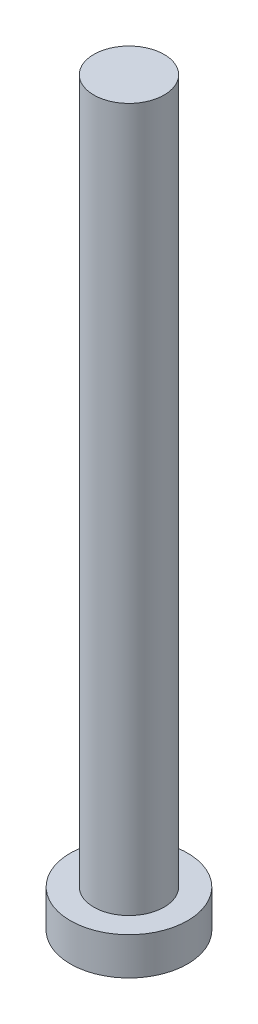
ISO-10303-21;
HEADER;
FILE_DESCRIPTION(('STEP AP214'),'2;1');
FILE_NAME('part.step','',(''),(''),'','','');
FILE_SCHEMA(('AUTOMOTIVE_DESIGN { 1 0 10303 214 1 1 1 1 }'));
ENDSEC;
DATA;
#1=APPLICATION_CONTEXT('core data for automotive mechanical design processes');
#2=APPLICATION_PROTOCOL_DEFINITION('international standard','automotive_design',2000,#1);
#3=PRODUCT_CONTEXT('',#1,'mechanical');
#4=PRODUCT('Part','Part','',(#3));
#5=PRODUCT_RELATED_PRODUCT_CATEGORY('part','',(#4));
#6=PRODUCT_DEFINITION_FORMATION('','',#4);
#7=PRODUCT_DEFINITION_CONTEXT('part definition',#1,'design');
#8=PRODUCT_DEFINITION('design','',#6,#7);
#9=PRODUCT_DEFINITION_SHAPE('','',#8);
#10=(LENGTH_UNIT() NAMED_UNIT(*) SI_UNIT(.MILLI.,.METRE.));
#11=(NAMED_UNIT(*) PLANE_ANGLE_UNIT() SI_UNIT($,.RADIAN.));
#12=(NAMED_UNIT(*) SI_UNIT($,.STERADIAN.) SOLID_ANGLE_UNIT());
#13=UNCERTAINTY_MEASURE_WITH_UNIT(LENGTH_MEASURE(1.E-05),#10,'distance_accuracy_value','');
#14=(GEOMETRIC_REPRESENTATION_CONTEXT(3) GLOBAL_UNCERTAINTY_ASSIGNED_CONTEXT((#13)) GLOBAL_UNIT_ASSIGNED_CONTEXT((#10,
#11,#12)) REPRESENTATION_CONTEXT('',''));
#15=CARTESIAN_POINT('',(0.,0.,0.));
#16=DIRECTION('',(0.,0.,1.));
#17=DIRECTION('',(1.,0.,0.));
#18=AXIS2_PLACEMENT_3D('',#15,#16,#17);
#19=CARTESIAN_POINT('',(0.,0.,0.));
#20=DIRECTION('',(0.,1.,0.));
#21=DIRECTION('',(0.,0.,1.));
#22=AXIS2_PLACEMENT_3D('',#19,#20,#21);
#23=PLANE('',#22);
#24=CARTESIAN_POINT('',(0.,0.,0.));
#25=DIRECTION('',(0.,1.,0.));
#26=DIRECTION('',(0.,0.,1.));
#27=AXIS2_PLACEMENT_3D('',#24,#25,#26);
#28=CIRCLE('',#27,2.5);
#29=CARTESIAN_POINT('',(0.,0.,2.5));
#30=VERTEX_POINT('',#29);
#31=EDGE_CURVE('E39',#30,#30,#28,.T.);
#32=ORIENTED_EDGE('',*,*,#31,.F.);
#33=EDGE_LOOP('',(#32));
#34=FACE_BOUND('',#33,.T.);
#35=CARTESIAN_POINT('',(1.,0.,1.));
#36=DIRECTION('',(0.,1.,0.));
#37=DIRECTION('',(0.,0.,-1.));
#38=AXIS2_PLACEMENT_3D('',#35,#36,#37);
#39=CIRCLE('',#38,0.5);
#40=CARTESIAN_POINT('',(1.,0.,0.5));
#41=VERTEX_POINT('',#40);
#42=CARTESIAN_POINT('',(0.5,0.,1.));
#43=VERTEX_POINT('',#42);
#44=EDGE_CURVE('E186',#41,#43,#39,.T.);
#45=ORIENTED_EDGE('',*,*,#44,.F.);
#46=DIRECTION('',(-1.,0.,0.));
#47=VECTOR('',#46,1.);
#48=CARTESIAN_POINT('',(1.,0.,0.5));
#49=LINE('',#48,#47);
#50=CARTESIAN_POINT('',(1.75,0.,0.5));
#51=VERTEX_POINT('',#50);
#52=EDGE_CURVE('E52',#51,#41,#49,.T.);
#53=ORIENTED_EDGE('',*,*,#52,.F.);
#54=DIRECTION('',(0.,0.,1.));
#55=VECTOR('',#54,1.);
#56=CARTESIAN_POINT('',(1.75,0.,-0.5));
#57=LINE('',#56,#55);
#58=CARTESIAN_POINT('',(1.75,0.,-0.5));
#59=VERTEX_POINT('',#58);
#60=EDGE_CURVE('E225',#59,#51,#57,.T.);
#61=ORIENTED_EDGE('',*,*,#60,.F.);
#62=DIRECTION('',(1.,0.,0.));
#63=VECTOR('',#62,1.);
#64=CARTESIAN_POINT('',(1.,0.,-0.5));
#65=LINE('',#64,#63);
#66=CARTESIAN_POINT('',(1.,0.,-0.5));
#67=VERTEX_POINT('',#66);
#68=EDGE_CURVE('E223',#67,#59,#65,.T.);
#69=ORIENTED_EDGE('',*,*,#68,.F.);
#70=CARTESIAN_POINT('',(1.,0.,-1.));
#71=DIRECTION('',(0.,1.,0.));
#72=DIRECTION('',(0.,0.,-1.));
#73=AXIS2_PLACEMENT_3D('',#70,#71,#72);
#74=CIRCLE('',#73,0.5);
#75=CARTESIAN_POINT('',(0.5,0.,-1.));
#76=VERTEX_POINT('',#75);
#77=EDGE_CURVE('E160',#76,#67,#74,.T.);
#78=ORIENTED_EDGE('',*,*,#77,.F.);
#79=DIRECTION('',(0.,0.,1.));
#80=VECTOR('',#79,1.);
#81=CARTESIAN_POINT('',(0.5,0.,-1.75));
#82=LINE('',#81,#80);
#83=CARTESIAN_POINT('',(0.5,0.,-1.75));
#84=VERTEX_POINT('',#83);
#85=EDGE_CURVE('E219',#84,#76,#82,.T.);
#86=ORIENTED_EDGE('',*,*,#85,.F.);
#87=DIRECTION('',(1.,0.,0.));
#88=VECTOR('',#87,1.);
#89=CARTESIAN_POINT('',(-0.5,0.,-1.75));
#90=LINE('',#89,#88);
#91=CARTESIAN_POINT('',(-0.5,0.,-1.75));
#92=VERTEX_POINT('',#91);
#93=EDGE_CURVE('E216',#92,#84,#90,.T.);
#94=ORIENTED_EDGE('',*,*,#93,.F.);
#95=DIRECTION('',(0.,0.,-1.));
#96=VECTOR('',#95,1.);
#97=CARTESIAN_POINT('',(-0.5,0.,-1.75));
#98=LINE('',#97,#96);
#99=CARTESIAN_POINT('',(-0.5,0.,-1.));
#100=VERTEX_POINT('',#99);
#101=EDGE_CURVE('E213',#100,#92,#98,.T.);
#102=ORIENTED_EDGE('',*,*,#101,.F.);
#103=CARTESIAN_POINT('',(-1.,0.,-1.));
#104=DIRECTION('',(0.,1.,0.));
#105=DIRECTION('',(0.,0.,-1.));
#106=AXIS2_PLACEMENT_3D('',#103,#104,#105);
#107=CIRCLE('',#106,0.5);
#108=CARTESIAN_POINT('',(-1.,0.,-0.5));
#109=VERTEX_POINT('',#108);
#110=EDGE_CURVE('E210',#109,#100,#107,.T.);
#111=ORIENTED_EDGE('',*,*,#110,.F.);
#112=DIRECTION('',(1.,0.,0.));
#113=VECTOR('',#112,1.);
#114=CARTESIAN_POINT('',(-1.75,0.,-0.5));
#115=LINE('',#114,#113);
#116=CARTESIAN_POINT('',(-1.75,0.,-0.5));
#117=VERTEX_POINT('',#116);
#118=EDGE_CURVE('E207',#117,#109,#115,.T.);
#119=ORIENTED_EDGE('',*,*,#118,.F.);
#120=DIRECTION('',(0.,0.,-1.));
#121=VECTOR('',#120,1.);
#122=CARTESIAN_POINT('',(-1.75,0.,-0.5));
#123=LINE('',#122,#121);
#124=CARTESIAN_POINT('',(-1.75,0.,0.5));
#125=VERTEX_POINT('',#124);
#126=EDGE_CURVE('E204',#125,#117,#123,.T.);
#127=ORIENTED_EDGE('',*,*,#126,.F.);
#128=DIRECTION('',(-1.,0.,0.));
#129=VECTOR('',#128,1.);
#130=CARTESIAN_POINT('',(-1.75,0.,0.5));
#131=LINE('',#130,#129);
#132=CARTESIAN_POINT('',(-1.,0.,0.5));
#133=VERTEX_POINT('',#132);
#134=EDGE_CURVE('E201',#133,#125,#131,.T.);
#135=ORIENTED_EDGE('',*,*,#134,.F.);
#136=CARTESIAN_POINT('',(-1.,0.,1.));
#137=DIRECTION('',(0.,1.,0.));
#138=DIRECTION('',(0.,0.,1.));
#139=AXIS2_PLACEMENT_3D('',#136,#137,#138);
#140=CIRCLE('',#139,0.5);
#141=CARTESIAN_POINT('',(-0.5,0.,1.));
#142=VERTEX_POINT('',#141);
#143=EDGE_CURVE('E198',#142,#133,#140,.T.);
#144=ORIENTED_EDGE('',*,*,#143,.F.);
#145=DIRECTION('',(0.,0.,-1.));
#146=VECTOR('',#145,1.);
#147=CARTESIAN_POINT('',(-0.5,0.,1.));
#148=LINE('',#147,#146);
#149=CARTESIAN_POINT('',(-0.5,0.,1.75));
#150=VERTEX_POINT('',#149);
#151=EDGE_CURVE('E195',#150,#142,#148,.T.);
#152=ORIENTED_EDGE('',*,*,#151,.F.);
#153=DIRECTION('',(-1.,0.,0.));
#154=VECTOR('',#153,1.);
#155=CARTESIAN_POINT('',(-0.5,0.,1.75));
#156=LINE('',#155,#154);
#157=CARTESIAN_POINT('',(0.5,0.,1.75));
#158=VERTEX_POINT('',#157);
#159=EDGE_CURVE('E192',#158,#150,#156,.T.);
#160=ORIENTED_EDGE('',*,*,#159,.F.);
#161=DIRECTION('',(0.,0.,1.));
#162=VECTOR('',#161,1.);
#163=CARTESIAN_POINT('',(0.5,0.,1.));
#164=LINE('',#163,#162);
#165=EDGE_CURVE('E189',#43,#158,#164,.T.);
#166=ORIENTED_EDGE('',*,*,#165,.F.);
#167=EDGE_LOOP('',(#45,#53,#61,#69,#78,#86,#94,#102,#111,#119,#127,#135,#144,#152,#160,#166));
#168=FACE_BOUND('',#167,.T.);
#169=ADVANCED_FACE('F35',(#34,#168),#23,.F.);
#170=CARTESIAN_POINT('',(0.,1.6,0.));
#171=DIRECTION('',(0.,-1.,0.));
#172=DIRECTION('',(0.,0.,-1.));
#173=AXIS2_PLACEMENT_3D('',#170,#171,#172);
#174=CYLINDRICAL_SURFACE('',#173,2.5);
#175=CARTESIAN_POINT('',(0.,1.6,0.));
#176=DIRECTION('',(0.,1.,0.));
#177=DIRECTION('',(0.,0.,1.));
#178=AXIS2_PLACEMENT_3D('',#175,#176,#177);
#179=CIRCLE('',#178,2.5);
#180=CARTESIAN_POINT('',(0.,1.6,2.5));
#181=VERTEX_POINT('',#180);
#182=EDGE_CURVE('E44',#181,#181,#179,.T.);
#183=ORIENTED_EDGE('',*,*,#182,.F.);
#184=EDGE_LOOP('',(#183));
#185=FACE_BOUND('',#184,.T.);
#186=ORIENTED_EDGE('',*,*,#31,.T.);
#187=EDGE_LOOP('',(#186));
#188=FACE_BOUND('',#187,.T.);
#189=ADVANCED_FACE('F37',(#185,#188),#174,.T.);
#190=CARTESIAN_POINT('',(0.,1.6,0.));
#191=DIRECTION('',(0.,1.,0.));
#192=DIRECTION('',(0.,0.,1.));
#193=AXIS2_PLACEMENT_3D('',#190,#191,#192);
#194=PLANE('',#193);
#195=CARTESIAN_POINT('',(0.,1.6,0.));
#196=DIRECTION('',(0.,1.,0.));
#197=DIRECTION('',(0.,0.,1.));
#198=AXIS2_PLACEMENT_3D('',#195,#196,#197);
#199=CIRCLE('',#198,1.5);
#200=CARTESIAN_POINT('',(0.,1.6,1.5));
#201=VERTEX_POINT('',#200);
#202=EDGE_CURVE('E11',#201,#201,#199,.T.);
#203=ORIENTED_EDGE('',*,*,#202,.F.);
#204=EDGE_LOOP('',(#203));
#205=FACE_BOUND('',#204,.T.);
#206=ORIENTED_EDGE('',*,*,#182,.T.);
#207=EDGE_LOOP('',(#206));
#208=FACE_BOUND('',#207,.T.);
#209=ADVANCED_FACE('F374',(#205,#208),#194,.T.);
#210=CARTESIAN_POINT('',(0.,31.6,0.));
#211=DIRECTION('',(0.,-1.,0.));
#212=DIRECTION('',(0.,0.,-1.));
#213=AXIS2_PLACEMENT_3D('',#210,#211,#212);
#214=CYLINDRICAL_SURFACE('',#213,1.5);
#215=CARTESIAN_POINT('',(0.,31.6,0.));
#216=DIRECTION('',(0.,1.,0.));
#217=DIRECTION('',(0.,0.,1.));
#218=AXIS2_PLACEMENT_3D('',#215,#216,#217);
#219=CIRCLE('',#218,1.5);
#220=CARTESIAN_POINT('',(0.,31.6,1.5));
#221=VERTEX_POINT('',#220);
#222=EDGE_CURVE('E229',#221,#221,#219,.T.);
#223=ORIENTED_EDGE('',*,*,#222,.F.);
#224=EDGE_LOOP('',(#223));
#225=FACE_BOUND('',#224,.T.);
#226=ORIENTED_EDGE('',*,*,#202,.T.);
#227=EDGE_LOOP('',(#226));
#228=FACE_BOUND('',#227,.T.);
#229=ADVANCED_FACE('F370',(#225,#228),#214,.T.);
#230=CARTESIAN_POINT('',(0.,31.6,0.));
#231=DIRECTION('',(0.,1.,0.));
#232=DIRECTION('',(0.,0.,1.));
#233=AXIS2_PLACEMENT_3D('',#230,#231,#232);
#234=PLANE('',#233);
#235=ORIENTED_EDGE('',*,*,#222,.T.);
#236=EDGE_LOOP('',(#235));
#237=FACE_BOUND('',#236,.T.);
#238=ADVANCED_FACE('F320',(#237),#234,.T.);
#239=CARTESIAN_POINT('',(1.,1.,0.5));
#240=DIRECTION('',(0.,0.,1.));
#241=DIRECTION('',(1.,0.,0.));
#242=AXIS2_PLACEMENT_3D('',#239,#240,#241);
#243=PLANE('',#242);
#244=ORIENTED_EDGE('',*,*,#52,.T.);
#245=DIRECTION('',(0.,-1.,0.));
#246=VECTOR('',#245,1.);
#247=CARTESIAN_POINT('',(1.,1.,0.5));
#248=LINE('',#247,#246);
#249=CARTESIAN_POINT('',(1.,1.,0.5));
#250=VERTEX_POINT('',#249);
#251=EDGE_CURVE('E112',#250,#41,#248,.T.);
#252=ORIENTED_EDGE('',*,*,#251,.F.);
#253=DIRECTION('',(-1.,0.,0.));
#254=VECTOR('',#253,1.);
#255=CARTESIAN_POINT('',(1.,1.,0.5));
#256=LINE('',#255,#254);
#257=CARTESIAN_POINT('',(1.75,1.,0.5));
#258=VERTEX_POINT('',#257);
#259=EDGE_CURVE('E227',#258,#250,#256,.T.);
#260=ORIENTED_EDGE('',*,*,#259,.F.);
#261=DIRECTION('',(0.,-1.,0.));
#262=VECTOR('',#261,1.);
#263=CARTESIAN_POINT('',(1.75,1.,0.5));
#264=LINE('',#263,#262);
#265=EDGE_CURVE('E60',#258,#51,#264,.T.);
#266=ORIENTED_EDGE('',*,*,#265,.T.);
#267=EDGE_LOOP('',(#244,#252,#260,#266));
#268=FACE_BOUND('',#267,.T.);
#269=ADVANCED_FACE('F313',(#268),#243,.F.);
#270=CARTESIAN_POINT('',(1.75,1.,-0.5));
#271=DIRECTION('',(1.,0.,0.));
#272=DIRECTION('',(0.,0.,-1.));
#273=AXIS2_PLACEMENT_3D('',#270,#271,#272);
#274=PLANE('',#273);
#275=ORIENTED_EDGE('',*,*,#60,.T.);
#276=ORIENTED_EDGE('',*,*,#265,.F.);
#277=DIRECTION('',(0.,0.,1.));
#278=VECTOR('',#277,1.);
#279=CARTESIAN_POINT('',(1.75,1.,-0.5));
#280=LINE('',#279,#278);
#281=CARTESIAN_POINT('',(1.75,1.,-0.5));
#282=VERTEX_POINT('',#281);
#283=EDGE_CURVE('E172',#282,#258,#280,.T.);
#284=ORIENTED_EDGE('',*,*,#283,.F.);
#285=DIRECTION('',(0.,-1.,0.));
#286=VECTOR('',#285,1.);
#287=CARTESIAN_POINT('',(1.75,1.,-0.5));
#288=LINE('',#287,#286);
#289=EDGE_CURVE('E164',#282,#59,#288,.T.);
#290=ORIENTED_EDGE('',*,*,#289,.T.);
#291=EDGE_LOOP('',(#275,#276,#284,#290));
#292=FACE_BOUND('',#291,.T.);
#293=ADVANCED_FACE('F311',(#292),#274,.F.);
#294=CARTESIAN_POINT('',(1.,1.,-0.5));
#295=DIRECTION('',(0.,0.,-1.));
#296=DIRECTION('',(-1.,0.,0.));
#297=AXIS2_PLACEMENT_3D('',#294,#295,#296);
#298=PLANE('',#297);
#299=ORIENTED_EDGE('',*,*,#68,.T.);
#300=ORIENTED_EDGE('',*,*,#289,.F.);
#301=DIRECTION('',(1.,0.,0.));
#302=VECTOR('',#301,1.);
#303=CARTESIAN_POINT('',(1.,1.,-0.5));
#304=LINE('',#303,#302);
#305=CARTESIAN_POINT('',(1.,1.,-0.5));
#306=VERTEX_POINT('',#305);
#307=EDGE_CURVE('E168',#306,#282,#304,.T.);
#308=ORIENTED_EDGE('',*,*,#307,.F.);
#309=DIRECTION('',(0.,-1.,0.));
#310=VECTOR('',#309,1.);
#311=CARTESIAN_POINT('',(1.,1.,-0.5));
#312=LINE('',#311,#310);
#313=EDGE_CURVE('E153',#306,#67,#312,.T.);
#314=ORIENTED_EDGE('',*,*,#313,.T.);
#315=EDGE_LOOP('',(#299,#300,#308,#314));
#316=FACE_BOUND('',#315,.T.);
#317=ADVANCED_FACE('F169',(#316),#298,.F.);
#318=CARTESIAN_POINT('',(1.,1.,-1.));
#319=DIRECTION('',(0.,-1.,0.));
#320=DIRECTION('',(0.,0.,-1.));
#321=AXIS2_PLACEMENT_3D('',#318,#319,#320);
#322=CYLINDRICAL_SURFACE('',#321,0.5);
#323=ORIENTED_EDGE('',*,*,#77,.T.);
#324=ORIENTED_EDGE('',*,*,#313,.F.);
#325=CARTESIAN_POINT('',(1.,1.,-1.));
#326=DIRECTION('',(0.,1.,0.));
#327=DIRECTION('',(0.,0.,-1.));
#328=AXIS2_PLACEMENT_3D('',#325,#326,#327);
#329=CIRCLE('',#328,0.5);
#330=CARTESIAN_POINT('',(0.5,1.,-1.));
#331=VERTEX_POINT('',#330);
#332=EDGE_CURVE('E157',#331,#306,#329,.T.);
#333=ORIENTED_EDGE('',*,*,#332,.F.);
#334=DIRECTION('',(0.,-1.,0.));
#335=VECTOR('',#334,1.);
#336=CARTESIAN_POINT('',(0.5,1.,-1.));
#337=LINE('',#336,#335);
#338=EDGE_CURVE('E165',#331,#76,#337,.T.);
#339=ORIENTED_EDGE('',*,*,#338,.T.);
#340=EDGE_LOOP('',(#323,#324,#333,#339));
#341=FACE_BOUND('',#340,.T.);
#342=ADVANCED_FACE('F155',(#341),#322,.T.);
#343=CARTESIAN_POINT('',(0.5,1.,-1.75));
#344=DIRECTION('',(1.,0.,0.));
#345=DIRECTION('',(0.,0.,-1.));
#346=AXIS2_PLACEMENT_3D('',#343,#344,#345);
#347=PLANE('',#346);
#348=ORIENTED_EDGE('',*,*,#85,.T.);
#349=ORIENTED_EDGE('',*,*,#338,.F.);
#350=DIRECTION('',(0.,0.,1.));
#351=VECTOR('',#350,1.);
#352=CARTESIAN_POINT('',(0.5,1.,-1.75));
#353=LINE('',#352,#351);
#354=CARTESIAN_POINT('',(0.5,1.,-1.75));
#355=VERTEX_POINT('',#354);
#356=EDGE_CURVE('E178',#355,#331,#353,.T.);
#357=ORIENTED_EDGE('',*,*,#356,.F.);
#358=DIRECTION('',(0.,-1.,0.));
#359=VECTOR('',#358,1.);
#360=CARTESIAN_POINT('',(0.5,1.,-1.75));
#361=LINE('',#360,#359);
#362=EDGE_CURVE('E232',#355,#84,#361,.T.);
#363=ORIENTED_EDGE('',*,*,#362,.T.);
#364=EDGE_LOOP('',(#348,#349,#357,#363));
#365=FACE_BOUND('',#364,.T.);
#366=ADVANCED_FACE('F310',(#365),#347,.F.);
#367=CARTESIAN_POINT('',(-0.5,1.,-1.75));
#368=DIRECTION('',(0.,0.,-1.));
#369=DIRECTION('',(-1.,0.,0.));
#370=AXIS2_PLACEMENT_3D('',#367,#368,#369);
#371=PLANE('',#370);
#372=ORIENTED_EDGE('',*,*,#93,.T.);
#373=ORIENTED_EDGE('',*,*,#362,.F.);
#374=DIRECTION('',(1.,0.,0.));
#375=VECTOR('',#374,1.);
#376=CARTESIAN_POINT('',(-0.5,1.,-1.75));
#377=LINE('',#376,#375);
#378=CARTESIAN_POINT('',(-0.5,1.,-1.75));
#379=VERTEX_POINT('',#378);
#380=EDGE_CURVE('E180',#379,#355,#377,.T.);
#381=ORIENTED_EDGE('',*,*,#380,.F.);
#382=DIRECTION('',(0.,-1.,0.));
#383=VECTOR('',#382,1.);
#384=CARTESIAN_POINT('',(-0.5,1.,-1.75));
#385=LINE('',#384,#383);
#386=EDGE_CURVE('E234',#379,#92,#385,.T.);
#387=ORIENTED_EDGE('',*,*,#386,.T.);
#388=EDGE_LOOP('',(#372,#373,#381,#387));
#389=FACE_BOUND('',#388,.T.);
#390=ADVANCED_FACE('F306',(#389),#371,.F.);
#391=CARTESIAN_POINT('',(-0.5,1.,-1.75));
#392=DIRECTION('',(-1.,0.,0.));
#393=DIRECTION('',(0.,0.,1.));
#394=AXIS2_PLACEMENT_3D('',#391,#392,#393);
#395=PLANE('',#394);
#396=ORIENTED_EDGE('',*,*,#101,.T.);
#397=ORIENTED_EDGE('',*,*,#386,.F.);
#398=DIRECTION('',(0.,0.,-1.));
#399=VECTOR('',#398,1.);
#400=CARTESIAN_POINT('',(-0.5,1.,-1.75));
#401=LINE('',#400,#399);
#402=CARTESIAN_POINT('',(-0.5,1.,-1.));
#403=VERTEX_POINT('',#402);
#404=EDGE_CURVE('E301',#403,#379,#401,.T.);
#405=ORIENTED_EDGE('',*,*,#404,.F.);
#406=DIRECTION('',(0.,-1.,0.));
#407=VECTOR('',#406,1.);
#408=CARTESIAN_POINT('',(-0.5,1.,-1.));
#409=LINE('',#408,#407);
#410=EDGE_CURVE('E236',#403,#100,#409,.T.);
#411=ORIENTED_EDGE('',*,*,#410,.T.);
#412=EDGE_LOOP('',(#396,#397,#405,#411));
#413=FACE_BOUND('',#412,.T.);
#414=ADVANCED_FACE('F330',(#413),#395,.F.);
#415=CARTESIAN_POINT('',(-1.,1.,-1.));
#416=DIRECTION('',(0.,-1.,0.));
#417=DIRECTION('',(0.,0.,-1.));
#418=AXIS2_PLACEMENT_3D('',#415,#416,#417);
#419=CYLINDRICAL_SURFACE('',#418,0.5);
#420=ORIENTED_EDGE('',*,*,#110,.T.);
#421=ORIENTED_EDGE('',*,*,#410,.F.);
#422=CARTESIAN_POINT('',(-1.,1.,-1.));
#423=DIRECTION('',(0.,1.,0.));
#424=DIRECTION('',(0.,0.,-1.));
#425=AXIS2_PLACEMENT_3D('',#422,#423,#424);
#426=CIRCLE('',#425,0.5);
#427=CARTESIAN_POINT('',(-1.,1.,-0.5));
#428=VERTEX_POINT('',#427);
#429=EDGE_CURVE('E298',#428,#403,#426,.T.);
#430=ORIENTED_EDGE('',*,*,#429,.F.);
#431=DIRECTION('',(0.,-1.,0.));
#432=VECTOR('',#431,1.);
#433=CARTESIAN_POINT('',(-1.,1.,-0.5));
#434=LINE('',#433,#432);
#435=EDGE_CURVE('E238',#428,#109,#434,.T.);
#436=ORIENTED_EDGE('',*,*,#435,.T.);
#437=EDGE_LOOP('',(#420,#421,#430,#436));
#438=FACE_BOUND('',#437,.T.);
#439=ADVANCED_FACE('F333',(#438),#419,.T.);
#440=CARTESIAN_POINT('',(-1.75,1.,-0.5));
#441=DIRECTION('',(0.,0.,-1.));
#442=DIRECTION('',(-1.,0.,0.));
#443=AXIS2_PLACEMENT_3D('',#440,#441,#442);
#444=PLANE('',#443);
#445=ORIENTED_EDGE('',*,*,#118,.T.);
#446=ORIENTED_EDGE('',*,*,#435,.F.);
#447=DIRECTION('',(1.,0.,0.));
#448=VECTOR('',#447,1.);
#449=CARTESIAN_POINT('',(-1.75,1.,-0.5));
#450=LINE('',#449,#448);
#451=CARTESIAN_POINT('',(-1.75,1.,-0.5));
#452=VERTEX_POINT('',#451);
#453=EDGE_CURVE('E295',#452,#428,#450,.T.);
#454=ORIENTED_EDGE('',*,*,#453,.F.);
#455=DIRECTION('',(0.,-1.,0.));
#456=VECTOR('',#455,1.);
#457=CARTESIAN_POINT('',(-1.75,1.,-0.5));
#458=LINE('',#457,#456);
#459=EDGE_CURVE('E240',#452,#117,#458,.T.);
#460=ORIENTED_EDGE('',*,*,#459,.T.);
#461=EDGE_LOOP('',(#445,#446,#454,#460));
#462=FACE_BOUND('',#461,.T.);
#463=ADVANCED_FACE('F337',(#462),#444,.F.);
#464=CARTESIAN_POINT('',(-1.75,1.,-0.5));
#465=DIRECTION('',(-1.,0.,0.));
#466=DIRECTION('',(0.,0.,1.));
#467=AXIS2_PLACEMENT_3D('',#464,#465,#466);
#468=PLANE('',#467);
#469=ORIENTED_EDGE('',*,*,#126,.T.);
#470=ORIENTED_EDGE('',*,*,#459,.F.);
#471=DIRECTION('',(0.,0.,-1.));
#472=VECTOR('',#471,1.);
#473=CARTESIAN_POINT('',(-1.75,1.,-0.5));
#474=LINE('',#473,#472);
#475=CARTESIAN_POINT('',(-1.75,1.,0.5));
#476=VERTEX_POINT('',#475);
#477=EDGE_CURVE('E292',#476,#452,#474,.T.);
#478=ORIENTED_EDGE('',*,*,#477,.F.);
#479=DIRECTION('',(0.,-1.,0.));
#480=VECTOR('',#479,1.);
#481=CARTESIAN_POINT('',(-1.75,1.,0.5));
#482=LINE('',#481,#480);
#483=EDGE_CURVE('E242',#476,#125,#482,.T.);
#484=ORIENTED_EDGE('',*,*,#483,.T.);
#485=EDGE_LOOP('',(#469,#470,#478,#484));
#486=FACE_BOUND('',#485,.T.);
#487=ADVANCED_FACE('F341',(#486),#468,.F.);
#488=CARTESIAN_POINT('',(-1.75,1.,0.5));
#489=DIRECTION('',(0.,0.,1.));
#490=DIRECTION('',(1.,0.,0.));
#491=AXIS2_PLACEMENT_3D('',#488,#489,#490);
#492=PLANE('',#491);
#493=ORIENTED_EDGE('',*,*,#134,.T.);
#494=ORIENTED_EDGE('',*,*,#483,.F.);
#495=DIRECTION('',(-1.,0.,0.));
#496=VECTOR('',#495,1.);
#497=CARTESIAN_POINT('',(-1.75,1.,0.5));
#498=LINE('',#497,#496);
#499=CARTESIAN_POINT('',(-1.,1.,0.5));
#500=VERTEX_POINT('',#499);
#501=EDGE_CURVE('E289',#500,#476,#498,.T.);
#502=ORIENTED_EDGE('',*,*,#501,.F.);
#503=DIRECTION('',(0.,-1.,0.));
#504=VECTOR('',#503,1.);
#505=CARTESIAN_POINT('',(-1.,1.,0.5));
#506=LINE('',#505,#504);
#507=EDGE_CURVE('E244',#500,#133,#506,.T.);
#508=ORIENTED_EDGE('',*,*,#507,.T.);
#509=EDGE_LOOP('',(#493,#494,#502,#508));
#510=FACE_BOUND('',#509,.T.);
#511=ADVANCED_FACE('F345',(#510),#492,.F.);
#512=CARTESIAN_POINT('',(-1.,1.,1.));
#513=DIRECTION('',(0.,-1.,0.));
#514=DIRECTION('',(0.,0.,-1.));
#515=AXIS2_PLACEMENT_3D('',#512,#513,#514);
#516=CYLINDRICAL_SURFACE('',#515,0.5);
#517=ORIENTED_EDGE('',*,*,#143,.T.);
#518=ORIENTED_EDGE('',*,*,#507,.F.);
#519=CARTESIAN_POINT('',(-1.,1.,1.));
#520=DIRECTION('',(0.,1.,0.));
#521=DIRECTION('',(0.,0.,1.));
#522=AXIS2_PLACEMENT_3D('',#519,#520,#521);
#523=CIRCLE('',#522,0.5);
#524=CARTESIAN_POINT('',(-0.5,1.,1.));
#525=VERTEX_POINT('',#524);
#526=EDGE_CURVE('E286',#525,#500,#523,.T.);
#527=ORIENTED_EDGE('',*,*,#526,.F.);
#528=DIRECTION('',(0.,-1.,0.));
#529=VECTOR('',#528,1.);
#530=CARTESIAN_POINT('',(-0.5,1.,1.));
#531=LINE('',#530,#529);
#532=EDGE_CURVE('E246',#525,#142,#531,.T.);
#533=ORIENTED_EDGE('',*,*,#532,.T.);
#534=EDGE_LOOP('',(#517,#518,#527,#533));
#535=FACE_BOUND('',#534,.T.);
#536=ADVANCED_FACE('F349',(#535),#516,.T.);
#537=CARTESIAN_POINT('',(-0.5,1.,1.));
#538=DIRECTION('',(-1.,0.,0.));
#539=DIRECTION('',(0.,0.,1.));
#540=AXIS2_PLACEMENT_3D('',#537,#538,#539);
#541=PLANE('',#540);
#542=ORIENTED_EDGE('',*,*,#151,.T.);
#543=ORIENTED_EDGE('',*,*,#532,.F.);
#544=DIRECTION('',(0.,0.,-1.));
#545=VECTOR('',#544,1.);
#546=CARTESIAN_POINT('',(-0.5,1.,1.));
#547=LINE('',#546,#545);
#548=CARTESIAN_POINT('',(-0.5,1.,1.75));
#549=VERTEX_POINT('',#548);
#550=EDGE_CURVE('E283',#549,#525,#547,.T.);
#551=ORIENTED_EDGE('',*,*,#550,.F.);
#552=DIRECTION('',(0.,-1.,0.));
#553=VECTOR('',#552,1.);
#554=CARTESIAN_POINT('',(-0.5,1.,1.75));
#555=LINE('',#554,#553);
#556=EDGE_CURVE('E248',#549,#150,#555,.T.);
#557=ORIENTED_EDGE('',*,*,#556,.T.);
#558=EDGE_LOOP('',(#542,#543,#551,#557));
#559=FACE_BOUND('',#558,.T.);
#560=ADVANCED_FACE('F353',(#559),#541,.F.);
#561=CARTESIAN_POINT('',(-0.5,1.,1.75));
#562=DIRECTION('',(0.,0.,1.));
#563=DIRECTION('',(1.,0.,0.));
#564=AXIS2_PLACEMENT_3D('',#561,#562,#563);
#565=PLANE('',#564);
#566=ORIENTED_EDGE('',*,*,#159,.T.);
#567=ORIENTED_EDGE('',*,*,#556,.F.);
#568=DIRECTION('',(-1.,0.,0.));
#569=VECTOR('',#568,1.);
#570=CARTESIAN_POINT('',(-0.5,1.,1.75));
#571=LINE('',#570,#569);
#572=CARTESIAN_POINT('',(0.5,1.,1.75));
#573=VERTEX_POINT('',#572);
#574=EDGE_CURVE('E280',#573,#549,#571,.T.);
#575=ORIENTED_EDGE('',*,*,#574,.F.);
#576=DIRECTION('',(0.,-1.,0.));
#577=VECTOR('',#576,1.);
#578=CARTESIAN_POINT('',(0.5,1.,1.75));
#579=LINE('',#578,#577);
#580=EDGE_CURVE('E250',#573,#158,#579,.T.);
#581=ORIENTED_EDGE('',*,*,#580,.T.);
#582=EDGE_LOOP('',(#566,#567,#575,#581));
#583=FACE_BOUND('',#582,.T.);
#584=ADVANCED_FACE('F357',(#583),#565,.F.);
#585=CARTESIAN_POINT('',(0.5,1.,1.));
#586=DIRECTION('',(1.,0.,0.));
#587=DIRECTION('',(0.,0.,-1.));
#588=AXIS2_PLACEMENT_3D('',#585,#586,#587);
#589=PLANE('',#588);
#590=ORIENTED_EDGE('',*,*,#165,.T.);
#591=ORIENTED_EDGE('',*,*,#580,.F.);
#592=DIRECTION('',(0.,0.,1.));
#593=VECTOR('',#592,1.);
#594=CARTESIAN_POINT('',(0.5,1.,1.));
#595=LINE('',#594,#593);
#596=CARTESIAN_POINT('',(0.5,1.,1.));
#597=VERTEX_POINT('',#596);
#598=EDGE_CURVE('E275',#597,#573,#595,.T.);
#599=ORIENTED_EDGE('',*,*,#598,.F.);
#600=DIRECTION('',(0.,-1.,0.));
#601=VECTOR('',#600,1.);
#602=CARTESIAN_POINT('',(0.5,1.,1.));
#603=LINE('',#602,#601);
#604=EDGE_CURVE('E252',#597,#43,#603,.T.);
#605=ORIENTED_EDGE('',*,*,#604,.T.);
#606=EDGE_LOOP('',(#590,#591,#599,#605));
#607=FACE_BOUND('',#606,.T.);
#608=ADVANCED_FACE('F361',(#607),#589,.F.);
#609=CARTESIAN_POINT('',(1.,1.,1.));
#610=DIRECTION('',(0.,-1.,0.));
#611=DIRECTION('',(0.,0.,-1.));
#612=AXIS2_PLACEMENT_3D('',#609,#610,#611);
#613=CYLINDRICAL_SURFACE('',#612,0.5);
#614=ORIENTED_EDGE('',*,*,#44,.T.);
#615=ORIENTED_EDGE('',*,*,#604,.F.);
#616=CARTESIAN_POINT('',(1.,1.,1.));
#617=DIRECTION('',(0.,1.,0.));
#618=DIRECTION('',(0.,0.,-1.));
#619=AXIS2_PLACEMENT_3D('',#616,#617,#618);
#620=CIRCLE('',#619,0.5);
#621=EDGE_CURVE('E273',#250,#597,#620,.T.);
#622=ORIENTED_EDGE('',*,*,#621,.F.);
#623=ORIENTED_EDGE('',*,*,#251,.T.);
#624=EDGE_LOOP('',(#614,#615,#622,#623));
#625=FACE_BOUND('',#624,.T.);
#626=ADVANCED_FACE('F270',(#625),#613,.T.);
#627=CARTESIAN_POINT('',(1.,1.,-1.));
#628=DIRECTION('',(0.,-1.,0.));
#629=DIRECTION('',(0.,0.,-1.));
#630=AXIS2_PLACEMENT_3D('',#627,#628,#629);
#631=PLANE('',#630);
#632=ORIENTED_EDGE('',*,*,#259,.T.);
#633=ORIENTED_EDGE('',*,*,#621,.T.);
#634=ORIENTED_EDGE('',*,*,#598,.T.);
#635=ORIENTED_EDGE('',*,*,#574,.T.);
#636=ORIENTED_EDGE('',*,*,#550,.T.);
#637=ORIENTED_EDGE('',*,*,#526,.T.);
#638=ORIENTED_EDGE('',*,*,#501,.T.);
#639=ORIENTED_EDGE('',*,*,#477,.T.);
#640=ORIENTED_EDGE('',*,*,#453,.T.);
#641=ORIENTED_EDGE('',*,*,#429,.T.);
#642=ORIENTED_EDGE('',*,*,#404,.T.);
#643=ORIENTED_EDGE('',*,*,#380,.T.);
#644=ORIENTED_EDGE('',*,*,#356,.T.);
#645=ORIENTED_EDGE('',*,*,#332,.T.);
#646=ORIENTED_EDGE('',*,*,#307,.T.);
#647=ORIENTED_EDGE('',*,*,#283,.T.);
#648=EDGE_LOOP('',(#632,#633,#634,#635,#636,#637,#638,#639,#640,#641,#642,#643,#644,#645,#646,#647));
#649=FACE_BOUND('',#648,.T.);
#650=ADVANCED_FACE('F175',(#649),#631,.T.);
#651=CLOSED_SHELL('',(#169,#189,#209,#229,#238,#269,#293,#317,#342,#366,#390,#414,#439,#463,
#487,#511,#536,#560,#584,#608,#626,#650));
#652=MANIFOLD_SOLID_BREP('B2',#651);
#653=ADVANCED_BREP_SHAPE_REPRESENTATION('',(#18,#652),#14);
#654=SHAPE_DEFINITION_REPRESENTATION(#9,#653);
ENDSEC;
END-ISO-10303-21;
